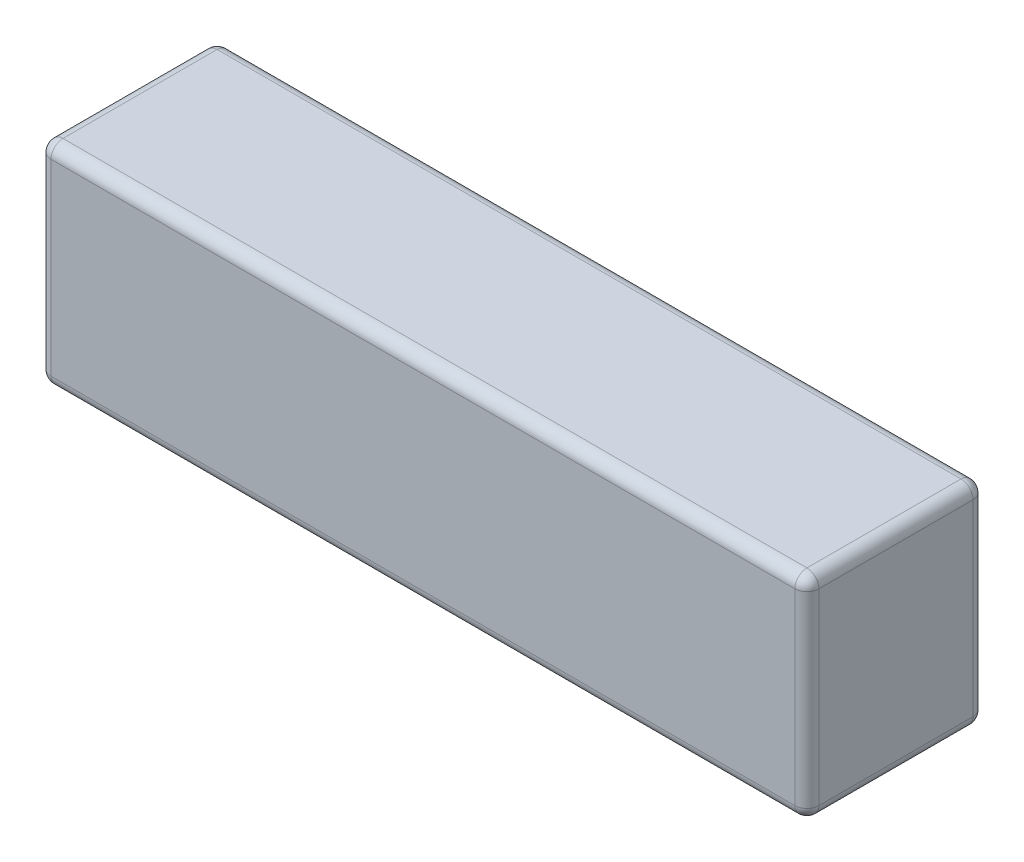
ISO-10303-21;
HEADER;
FILE_DESCRIPTION(('STEP AP214'),'2;1');
FILE_NAME('part.step','',(''),(''),'','','');
FILE_SCHEMA(('AUTOMOTIVE_DESIGN { 1 0 10303 214 1 1 1 1 }'));
ENDSEC;
DATA;
#1=APPLICATION_CONTEXT('core data for automotive mechanical design processes');
#2=APPLICATION_PROTOCOL_DEFINITION('international standard','automotive_design',2000,#1);
#3=PRODUCT_CONTEXT('',#1,'mechanical');
#4=PRODUCT('Part','Part','',(#3));
#5=PRODUCT_RELATED_PRODUCT_CATEGORY('part','',(#4));
#6=PRODUCT_DEFINITION_FORMATION('','',#4);
#7=PRODUCT_DEFINITION_CONTEXT('part definition',#1,'design');
#8=PRODUCT_DEFINITION('design','',#6,#7);
#9=PRODUCT_DEFINITION_SHAPE('','',#8);
#10=(LENGTH_UNIT() NAMED_UNIT(*) SI_UNIT(.MILLI.,.METRE.));
#11=(NAMED_UNIT(*) PLANE_ANGLE_UNIT() SI_UNIT($,.RADIAN.));
#12=(NAMED_UNIT(*) SI_UNIT($,.STERADIAN.) SOLID_ANGLE_UNIT());
#13=UNCERTAINTY_MEASURE_WITH_UNIT(LENGTH_MEASURE(1.E-05),#10,'distance_accuracy_value','');
#14=(GEOMETRIC_REPRESENTATION_CONTEXT(3) GLOBAL_UNCERTAINTY_ASSIGNED_CONTEXT((#13)) GLOBAL_UNIT_ASSIGNED_CONTEXT((#10,
#11,#12)) REPRESENTATION_CONTEXT('',''));
#15=CARTESIAN_POINT('',(0.,0.,0.));
#16=DIRECTION('',(0.,0.,1.));
#17=DIRECTION('',(1.,0.,0.));
#18=AXIS2_PLACEMENT_3D('',#15,#16,#17);
#19=CARTESIAN_POINT('',(-159.5,-44.,74.));
#20=DIRECTION('',(-1.,0.,0.));
#21=DIRECTION('',(0.,0.,1.));
#22=AXIS2_PLACEMENT_3D('',#19,#20,#21);
#23=PLANE('',#22);
#24=DIRECTION('',(0.,1.,0.));
#25=VECTOR('',#24,1.);
#26=CARTESIAN_POINT('',(-159.5,44.,69.));
#27=LINE('',#26,#25);
#28=CARTESIAN_POINT('',(-159.5,-39.,69.));
#29=VERTEX_POINT('',#28);
#30=CARTESIAN_POINT('',(-159.5,39.,69.));
#31=VERTEX_POINT('',#30);
#32=EDGE_CURVE('E200',#29,#31,#27,.T.);
#33=ORIENTED_EDGE('',*,*,#32,.T.);
#34=DIRECTION('',(0.,0.,-1.));
#35=VECTOR('',#34,1.);
#36=CARTESIAN_POINT('',(-159.5,39.,74.));
#37=LINE('',#36,#35);
#38=CARTESIAN_POINT('',(-159.5,39.,5.));
#39=VERTEX_POINT('',#38);
#40=EDGE_CURVE('E202',#31,#39,#37,.T.);
#41=ORIENTED_EDGE('',*,*,#40,.T.);
#42=DIRECTION('',(0.,1.,0.));
#43=VECTOR('',#42,1.);
#44=CARTESIAN_POINT('',(-159.5,-44.,5.));
#45=LINE('',#44,#43);
#46=CARTESIAN_POINT('',(-159.5,-39.,5.));
#47=VERTEX_POINT('',#46);
#48=EDGE_CURVE('E196',#39,#47,#45,.F.);
#49=ORIENTED_EDGE('',*,*,#48,.T.);
#50=DIRECTION('',(0.,0.,-1.));
#51=VECTOR('',#50,1.);
#52=CARTESIAN_POINT('',(-159.5,-39.,74.));
#53=LINE('',#52,#51);
#54=EDGE_CURVE('E198',#47,#29,#53,.F.);
#55=ORIENTED_EDGE('',*,*,#54,.T.);
#56=EDGE_LOOP('',(#33,#41,#49,#55));
#57=FACE_BOUND('',#56,.T.);
#58=ADVANCED_FACE('F40',(#57),#23,.T.);
#59=CARTESIAN_POINT('',(-159.5,-44.,74.));
#60=DIRECTION('',(0.,1.,0.));
#61=DIRECTION('',(0.,0.,1.));
#62=AXIS2_PLACEMENT_3D('',#59,#60,#61);
#63=PLANE('',#62);
#64=DIRECTION('',(0.,0.,-1.));
#65=VECTOR('',#64,1.);
#66=CARTESIAN_POINT('',(-154.5,-44.,0.));
#67=LINE('',#66,#65);
#68=CARTESIAN_POINT('',(-154.5,-44.,69.));
#69=VERTEX_POINT('',#68);
#70=CARTESIAN_POINT('',(-154.5,-44.,5.));
#71=VERTEX_POINT('',#70);
#72=EDGE_CURVE('E165',#69,#71,#67,.T.);
#73=ORIENTED_EDGE('',*,*,#72,.T.);
#74=DIRECTION('',(1.,0.,0.));
#75=VECTOR('',#74,1.);
#76=CARTESIAN_POINT('',(159.5,-44.,5.));
#77=LINE('',#76,#75);
#78=CARTESIAN_POINT('',(154.5,-44.,5.));
#79=VERTEX_POINT('',#78);
#80=EDGE_CURVE('E137',#71,#79,#77,.T.);
#81=ORIENTED_EDGE('',*,*,#80,.T.);
#82=DIRECTION('',(0.,0.,-1.));
#83=VECTOR('',#82,1.);
#84=CARTESIAN_POINT('',(154.5,-44.,74.));
#85=LINE('',#84,#83);
#86=CARTESIAN_POINT('',(154.5,-44.,69.));
#87=VERTEX_POINT('',#86);
#88=EDGE_CURVE('E155',#79,#87,#85,.F.);
#89=ORIENTED_EDGE('',*,*,#88,.T.);
#90=DIRECTION('',(1.,0.,0.));
#91=VECTOR('',#90,1.);
#92=CARTESIAN_POINT('',(-159.5,-44.,69.));
#93=LINE('',#92,#91);
#94=EDGE_CURVE('E161',#87,#69,#93,.F.);
#95=ORIENTED_EDGE('',*,*,#94,.T.);
#96=EDGE_LOOP('',(#73,#81,#89,#95));
#97=FACE_BOUND('',#96,.T.);
#98=ADVANCED_FACE('F163',(#97),#63,.F.);
#99=CARTESIAN_POINT('',(159.5,-44.,74.));
#100=DIRECTION('',(-1.,0.,0.));
#101=DIRECTION('',(0.,0.,1.));
#102=AXIS2_PLACEMENT_3D('',#99,#100,#101);
#103=PLANE('',#102);
#104=DIRECTION('',(0.,0.,-1.));
#105=VECTOR('',#104,1.);
#106=CARTESIAN_POINT('',(159.5,-39.,74.));
#107=LINE('',#106,#105);
#108=CARTESIAN_POINT('',(159.5,-39.,69.));
#109=VERTEX_POINT('',#108);
#110=CARTESIAN_POINT('',(159.5,-39.,5.));
#111=VERTEX_POINT('',#110);
#112=EDGE_CURVE('E182',#109,#111,#107,.T.);
#113=ORIENTED_EDGE('',*,*,#112,.T.);
#114=DIRECTION('',(0.,1.,0.));
#115=VECTOR('',#114,1.);
#116=CARTESIAN_POINT('',(159.5,44.,5.));
#117=LINE('',#116,#115);
#118=CARTESIAN_POINT('',(159.5,39.,5.));
#119=VERTEX_POINT('',#118);
#120=EDGE_CURVE('E184',#111,#119,#117,.T.);
#121=ORIENTED_EDGE('',*,*,#120,.T.);
#122=DIRECTION('',(0.,0.,-1.));
#123=VECTOR('',#122,1.);
#124=CARTESIAN_POINT('',(159.5,39.,74.));
#125=LINE('',#124,#123);
#126=CARTESIAN_POINT('',(159.5,39.,69.));
#127=VERTEX_POINT('',#126);
#128=EDGE_CURVE('E178',#119,#127,#125,.F.);
#129=ORIENTED_EDGE('',*,*,#128,.T.);
#130=DIRECTION('',(0.,1.,0.));
#131=VECTOR('',#130,1.);
#132=CARTESIAN_POINT('',(159.5,-44.,69.));
#133=LINE('',#132,#131);
#134=EDGE_CURVE('E180',#127,#109,#133,.F.);
#135=ORIENTED_EDGE('',*,*,#134,.T.);
#136=EDGE_LOOP('',(#113,#121,#129,#135));
#137=FACE_BOUND('',#136,.T.);
#138=ADVANCED_FACE('F329',(#137),#103,.F.);
#139=CARTESIAN_POINT('',(-159.5,44.,74.));
#140=DIRECTION('',(0.,1.,0.));
#141=DIRECTION('',(0.,0.,1.));
#142=AXIS2_PLACEMENT_3D('',#139,#140,#141);
#143=PLANE('',#142);
#144=DIRECTION('',(0.,0.,-1.));
#145=VECTOR('',#144,1.);
#146=CARTESIAN_POINT('',(154.5,44.,0.));
#147=LINE('',#146,#145);
#148=CARTESIAN_POINT('',(154.5,44.,69.));
#149=VERTEX_POINT('',#148);
#150=CARTESIAN_POINT('',(154.5,44.,5.));
#151=VERTEX_POINT('',#150);
#152=EDGE_CURVE('E189',#149,#151,#147,.T.);
#153=ORIENTED_EDGE('',*,*,#152,.T.);
#154=DIRECTION('',(1.,0.,0.));
#155=VECTOR('',#154,1.);
#156=CARTESIAN_POINT('',(-159.5,44.,5.));
#157=LINE('',#156,#155);
#158=CARTESIAN_POINT('',(-154.5,44.,5.));
#159=VERTEX_POINT('',#158);
#160=EDGE_CURVE('E193',#151,#159,#157,.F.);
#161=ORIENTED_EDGE('',*,*,#160,.T.);
#162=DIRECTION('',(0.,0.,-1.));
#163=VECTOR('',#162,1.);
#164=CARTESIAN_POINT('',(-154.5,44.,74.));
#165=LINE('',#164,#163);
#166=CARTESIAN_POINT('',(-154.5,44.,69.));
#167=VERTEX_POINT('',#166);
#168=EDGE_CURVE('E191',#159,#167,#165,.F.);
#169=ORIENTED_EDGE('',*,*,#168,.T.);
#170=DIRECTION('',(1.,0.,0.));
#171=VECTOR('',#170,1.);
#172=CARTESIAN_POINT('',(159.5,44.,69.));
#173=LINE('',#172,#171);
#174=EDGE_CURVE('E187',#167,#149,#173,.T.);
#175=ORIENTED_EDGE('',*,*,#174,.T.);
#176=EDGE_LOOP('',(#153,#161,#169,#175));
#177=FACE_BOUND('',#176,.T.);
#178=ADVANCED_FACE('F293',(#177),#143,.T.);
#179=CARTESIAN_POINT('',(0.,0.,74.));
#180=DIRECTION('',(0.,0.,-1.));
#181=DIRECTION('',(-1.,0.,0.));
#182=AXIS2_PLACEMENT_3D('',#179,#180,#181);
#183=PLANE('',#182);
#184=DIRECTION('',(1.,0.,0.));
#185=VECTOR('',#184,1.);
#186=CARTESIAN_POINT('',(-159.5,39.,74.));
#187=LINE('',#186,#185);
#188=CARTESIAN_POINT('',(154.5,39.,74.));
#189=VERTEX_POINT('',#188);
#190=CARTESIAN_POINT('',(-154.5,39.,74.));
#191=VERTEX_POINT('',#190);
#192=EDGE_CURVE('E205',#189,#191,#187,.F.);
#193=ORIENTED_EDGE('',*,*,#192,.T.);
#194=DIRECTION('',(0.,1.,0.));
#195=VECTOR('',#194,1.);
#196=CARTESIAN_POINT('',(-154.5,-44.,74.));
#197=LINE('',#196,#195);
#198=CARTESIAN_POINT('',(-154.5,-39.,74.));
#199=VERTEX_POINT('',#198);
#200=EDGE_CURVE('E11',#191,#199,#197,.F.);
#201=ORIENTED_EDGE('',*,*,#200,.T.);
#202=DIRECTION('',(1.,0.,0.));
#203=VECTOR('',#202,1.);
#204=CARTESIAN_POINT('',(0.,-39.,74.));
#205=LINE('',#204,#203);
#206=CARTESIAN_POINT('',(154.5,-39.,74.));
#207=VERTEX_POINT('',#206);
#208=EDGE_CURVE('E49',#199,#207,#205,.T.);
#209=ORIENTED_EDGE('',*,*,#208,.T.);
#210=DIRECTION('',(0.,1.,0.));
#211=VECTOR('',#210,1.);
#212=CARTESIAN_POINT('',(154.5,0.,74.));
#213=LINE('',#212,#211);
#214=EDGE_CURVE('E207',#207,#189,#213,.T.);
#215=ORIENTED_EDGE('',*,*,#214,.T.);
#216=EDGE_LOOP('',(#193,#201,#209,#215));
#217=FACE_BOUND('',#216,.T.);
#218=ADVANCED_FACE('F283',(#217),#183,.F.);
#219=CARTESIAN_POINT('',(0.,0.,0.));
#220=DIRECTION('',(0.,0.,-1.));
#221=DIRECTION('',(-1.,0.,0.));
#222=AXIS2_PLACEMENT_3D('',#219,#220,#221);
#223=PLANE('',#222);
#224=DIRECTION('',(0.,1.,0.));
#225=VECTOR('',#224,1.);
#226=CARTESIAN_POINT('',(154.5,-44.,0.));
#227=LINE('',#226,#225);
#228=CARTESIAN_POINT('',(154.5,39.,0.));
#229=VERTEX_POINT('',#228);
#230=CARTESIAN_POINT('',(154.5,-39.,0.));
#231=VERTEX_POINT('',#230);
#232=EDGE_CURVE('E175',#229,#231,#227,.F.);
#233=ORIENTED_EDGE('',*,*,#232,.T.);
#234=DIRECTION('',(1.,0.,0.));
#235=VECTOR('',#234,1.);
#236=CARTESIAN_POINT('',(-159.5,-39.,0.));
#237=LINE('',#236,#235);
#238=CARTESIAN_POINT('',(-154.5,-39.,0.));
#239=VERTEX_POINT('',#238);
#240=EDGE_CURVE('E139',#231,#239,#237,.F.);
#241=ORIENTED_EDGE('',*,*,#240,.T.);
#242=DIRECTION('',(0.,1.,0.));
#243=VECTOR('',#242,1.);
#244=CARTESIAN_POINT('',(-154.5,0.,0.));
#245=LINE('',#244,#243);
#246=CARTESIAN_POINT('',(-154.5,39.,0.));
#247=VERTEX_POINT('',#246);
#248=EDGE_CURVE('E167',#239,#247,#245,.T.);
#249=ORIENTED_EDGE('',*,*,#248,.T.);
#250=DIRECTION('',(1.,0.,0.));
#251=VECTOR('',#250,1.);
#252=CARTESIAN_POINT('',(0.,39.,0.));
#253=LINE('',#252,#251);
#254=EDGE_CURVE('E169',#247,#229,#253,.T.);
#255=ORIENTED_EDGE('',*,*,#254,.T.);
#256=EDGE_LOOP('',(#233,#241,#249,#255));
#257=FACE_BOUND('',#256,.T.);
#258=ADVANCED_FACE('F357',(#257),#223,.T.);
#259=CARTESIAN_POINT('',(-159.5,39.,69.));
#260=DIRECTION('',(-1.,0.,0.));
#261=DIRECTION('',(0.,0.,1.));
#262=AXIS2_PLACEMENT_3D('',#259,#260,#261);
#263=CYLINDRICAL_SURFACE('',#262,5.);
#264=CARTESIAN_POINT('',(-154.5,39.,69.));
#265=DIRECTION('',(-1.,0.,0.));
#266=DIRECTION('',(0.,0.,1.));
#267=AXIS2_PLACEMENT_3D('',#264,#265,#266);
#268=CIRCLE('',#267,5.);
#269=EDGE_CURVE('E44',#191,#167,#268,.T.);
#270=ORIENTED_EDGE('',*,*,#269,.F.);
#271=ORIENTED_EDGE('',*,*,#192,.F.);
#272=CARTESIAN_POINT('',(154.5,39.,69.));
#273=DIRECTION('',(1.,0.,0.));
#274=DIRECTION('',(0.,0.,-1.));
#275=AXIS2_PLACEMENT_3D('',#272,#273,#274);
#276=CIRCLE('',#275,5.);
#277=EDGE_CURVE('E257',#149,#189,#276,.T.);
#278=ORIENTED_EDGE('',*,*,#277,.F.);
#279=ORIENTED_EDGE('',*,*,#174,.F.);
#280=EDGE_LOOP('',(#270,#271,#278,#279));
#281=FACE_BOUND('',#280,.T.);
#282=ADVANCED_FACE('F42',(#281),#263,.T.);
#283=CARTESIAN_POINT('',(-154.5,39.,69.));
#284=DIRECTION('',(0.,1.,0.));
#285=DIRECTION('',(0.,0.,1.));
#286=AXIS2_PLACEMENT_3D('',#283,#284,#285);
#287=SPHERICAL_SURFACE('',#286,5.);
#288=CARTESIAN_POINT('',(-154.5,39.,69.));
#289=DIRECTION('',(0.,1.,0.));
#290=DIRECTION('',(0.,0.,1.));
#291=AXIS2_PLACEMENT_3D('',#288,#289,#290);
#292=CIRCLE('',#291,5.);
#293=EDGE_CURVE('E252',#191,#31,#292,.F.);
#294=ORIENTED_EDGE('',*,*,#293,.F.);
#295=ORIENTED_EDGE('',*,*,#269,.T.);
#296=CARTESIAN_POINT('',(-154.5,39.,69.));
#297=DIRECTION('',(0.,0.,1.));
#298=DIRECTION('',(1.,0.,0.));
#299=AXIS2_PLACEMENT_3D('',#296,#297,#298);
#300=CIRCLE('',#299,5.);
#301=EDGE_CURVE('E255',#31,#167,#300,.F.);
#302=ORIENTED_EDGE('',*,*,#301,.F.);
#303=EDGE_LOOP('',(#294,#295,#302));
#304=FACE_BOUND('',#303,.T.);
#305=ADVANCED_FACE('F268',(#304),#287,.T.);
#306=CARTESIAN_POINT('',(154.5,39.,69.));
#307=DIRECTION('',(0.,0.,1.));
#308=DIRECTION('',(1.,0.,0.));
#309=AXIS2_PLACEMENT_3D('',#306,#307,#308);
#310=SPHERICAL_SURFACE('',#309,5.);
#311=CARTESIAN_POINT('',(154.5,39.,69.));
#312=DIRECTION('',(0.,0.,1.));
#313=DIRECTION('',(1.,0.,0.));
#314=AXIS2_PLACEMENT_3D('',#311,#312,#313);
#315=CIRCLE('',#314,5.);
#316=EDGE_CURVE('E246',#149,#127,#315,.F.);
#317=ORIENTED_EDGE('',*,*,#316,.F.);
#318=ORIENTED_EDGE('',*,*,#277,.T.);
#319=CARTESIAN_POINT('',(154.5,39.,69.));
#320=DIRECTION('',(0.,1.,0.));
#321=DIRECTION('',(0.,0.,1.));
#322=AXIS2_PLACEMENT_3D('',#319,#320,#321);
#323=CIRCLE('',#322,5.);
#324=EDGE_CURVE('E249',#127,#189,#323,.F.);
#325=ORIENTED_EDGE('',*,*,#324,.F.);
#326=EDGE_LOOP('',(#317,#318,#325));
#327=FACE_BOUND('',#326,.T.);
#328=ADVANCED_FACE('F285',(#327),#310,.T.);
#329=CARTESIAN_POINT('',(-154.5,39.,74.));
#330=DIRECTION('',(0.,0.,-1.));
#331=DIRECTION('',(-1.,0.,0.));
#332=AXIS2_PLACEMENT_3D('',#329,#330,#331);
#333=CYLINDRICAL_SURFACE('',#332,5.);
#334=ORIENTED_EDGE('',*,*,#301,.T.);
#335=ORIENTED_EDGE('',*,*,#168,.F.);
#336=CARTESIAN_POINT('',(-154.5,39.,5.));
#337=DIRECTION('',(0.,0.,-1.));
#338=DIRECTION('',(-1.,0.,0.));
#339=AXIS2_PLACEMENT_3D('',#336,#337,#338);
#340=CIRCLE('',#339,5.);
#341=EDGE_CURVE('E241',#39,#159,#340,.T.);
#342=ORIENTED_EDGE('',*,*,#341,.F.);
#343=ORIENTED_EDGE('',*,*,#40,.F.);
#344=EDGE_LOOP('',(#334,#335,#342,#343));
#345=FACE_BOUND('',#344,.T.);
#346=ADVANCED_FACE('F276',(#345),#333,.T.);
#347=CARTESIAN_POINT('',(-154.5,-44.,69.));
#348=DIRECTION('',(0.,-1.,0.));
#349=DIRECTION('',(0.,0.,-1.));
#350=AXIS2_PLACEMENT_3D('',#347,#348,#349);
#351=CYLINDRICAL_SURFACE('',#350,5.);
#352=ORIENTED_EDGE('',*,*,#293,.T.);
#353=ORIENTED_EDGE('',*,*,#32,.F.);
#354=CARTESIAN_POINT('',(-154.5,-39.,69.));
#355=DIRECTION('',(0.,-1.,0.));
#356=DIRECTION('',(0.,0.,-1.));
#357=AXIS2_PLACEMENT_3D('',#354,#355,#356);
#358=CIRCLE('',#357,5.);
#359=EDGE_CURVE('E239',#199,#29,#358,.T.);
#360=ORIENTED_EDGE('',*,*,#359,.F.);
#361=ORIENTED_EDGE('',*,*,#200,.F.);
#362=EDGE_LOOP('',(#352,#353,#360,#361));
#363=FACE_BOUND('',#362,.T.);
#364=ADVANCED_FACE('F282',(#363),#351,.T.);
#365=CARTESIAN_POINT('',(0.,-39.,69.));
#366=DIRECTION('',(1.,0.,0.));
#367=DIRECTION('',(0.,0.,-1.));
#368=AXIS2_PLACEMENT_3D('',#365,#366,#367);
#369=CYLINDRICAL_SURFACE('',#368,5.);
#370=CARTESIAN_POINT('',(154.5,-39.,69.));
#371=DIRECTION('',(1.,0.,0.));
#372=DIRECTION('',(0.,0.,-1.));
#373=AXIS2_PLACEMENT_3D('',#370,#371,#372);
#374=CIRCLE('',#373,5.);
#375=EDGE_CURVE('E235',#207,#87,#374,.T.);
#376=ORIENTED_EDGE('',*,*,#375,.F.);
#377=ORIENTED_EDGE('',*,*,#208,.F.);
#378=CARTESIAN_POINT('',(-154.5,-39.,69.));
#379=DIRECTION('',(-1.,0.,0.));
#380=DIRECTION('',(0.,0.,1.));
#381=AXIS2_PLACEMENT_3D('',#378,#379,#380);
#382=CIRCLE('',#381,5.);
#383=EDGE_CURVE('E57',#69,#199,#382,.T.);
#384=ORIENTED_EDGE('',*,*,#383,.F.);
#385=ORIENTED_EDGE('',*,*,#94,.F.);
#386=EDGE_LOOP('',(#376,#377,#384,#385));
#387=FACE_BOUND('',#386,.T.);
#388=ADVANCED_FACE('F375',(#387),#369,.T.);
#389=CARTESIAN_POINT('',(154.5,0.,69.));
#390=DIRECTION('',(0.,1.,0.));
#391=DIRECTION('',(0.,0.,1.));
#392=AXIS2_PLACEMENT_3D('',#389,#390,#391);
#393=CYLINDRICAL_SURFACE('',#392,5.);
#394=ORIENTED_EDGE('',*,*,#324,.T.);
#395=ORIENTED_EDGE('',*,*,#214,.F.);
#396=CARTESIAN_POINT('',(154.5,-39.,69.));
#397=DIRECTION('',(0.,-1.,0.));
#398=DIRECTION('',(0.,0.,-1.));
#399=AXIS2_PLACEMENT_3D('',#396,#397,#398);
#400=CIRCLE('',#399,5.);
#401=EDGE_CURVE('E232',#109,#207,#400,.T.);
#402=ORIENTED_EDGE('',*,*,#401,.F.);
#403=ORIENTED_EDGE('',*,*,#134,.F.);
#404=EDGE_LOOP('',(#394,#395,#402,#403));
#405=FACE_BOUND('',#404,.T.);
#406=ADVANCED_FACE('F372',(#405),#393,.T.);
#407=CARTESIAN_POINT('',(154.5,39.,74.));
#408=DIRECTION('',(0.,0.,1.));
#409=DIRECTION('',(1.,0.,0.));
#410=AXIS2_PLACEMENT_3D('',#407,#408,#409);
#411=CYLINDRICAL_SURFACE('',#410,5.);
#412=ORIENTED_EDGE('',*,*,#316,.T.);
#413=ORIENTED_EDGE('',*,*,#128,.F.);
#414=CARTESIAN_POINT('',(154.5,39.,5.));
#415=DIRECTION('',(0.,0.,-1.));
#416=DIRECTION('',(-1.,0.,0.));
#417=AXIS2_PLACEMENT_3D('',#414,#415,#416);
#418=CIRCLE('',#417,5.);
#419=EDGE_CURVE('E229',#151,#119,#418,.T.);
#420=ORIENTED_EDGE('',*,*,#419,.F.);
#421=ORIENTED_EDGE('',*,*,#152,.F.);
#422=EDGE_LOOP('',(#412,#413,#420,#421));
#423=FACE_BOUND('',#422,.T.);
#424=ADVANCED_FACE('F290',(#423),#411,.T.);
#425=CARTESIAN_POINT('',(0.,39.,5.));
#426=DIRECTION('',(1.,0.,0.));
#427=DIRECTION('',(0.,0.,-1.));
#428=AXIS2_PLACEMENT_3D('',#425,#426,#427);
#429=CYLINDRICAL_SURFACE('',#428,5.);
#430=CARTESIAN_POINT('',(-154.5,39.,5.));
#431=DIRECTION('',(-1.,0.,0.));
#432=DIRECTION('',(0.,0.,1.));
#433=AXIS2_PLACEMENT_3D('',#430,#431,#432);
#434=CIRCLE('',#433,5.);
#435=EDGE_CURVE('E243',#159,#247,#434,.T.);
#436=ORIENTED_EDGE('',*,*,#435,.F.);
#437=ORIENTED_EDGE('',*,*,#160,.F.);
#438=CARTESIAN_POINT('',(154.5,39.,5.));
#439=DIRECTION('',(1.,0.,0.));
#440=DIRECTION('',(0.,0.,-1.));
#441=AXIS2_PLACEMENT_3D('',#438,#439,#440);
#442=CIRCLE('',#441,5.);
#443=EDGE_CURVE('E226',#229,#151,#442,.T.);
#444=ORIENTED_EDGE('',*,*,#443,.F.);
#445=ORIENTED_EDGE('',*,*,#254,.F.);
#446=EDGE_LOOP('',(#436,#437,#444,#445));
#447=FACE_BOUND('',#446,.T.);
#448=ADVANCED_FACE('F297',(#447),#429,.T.);
#449=CARTESIAN_POINT('',(-154.5,39.,5.));
#450=DIRECTION('',(0.,1.,0.));
#451=DIRECTION('',(0.,0.,1.));
#452=AXIS2_PLACEMENT_3D('',#449,#450,#451);
#453=SPHERICAL_SURFACE('',#452,5.);
#454=ORIENTED_EDGE('',*,*,#341,.T.);
#455=ORIENTED_EDGE('',*,*,#435,.T.);
#456=CARTESIAN_POINT('',(-154.5,39.,5.));
#457=DIRECTION('',(0.,1.,0.));
#458=DIRECTION('',(-1.,0.,0.));
#459=AXIS2_PLACEMENT_3D('',#456,#457,#458);
#460=CIRCLE('',#459,5.);
#461=EDGE_CURVE('E223',#39,#247,#460,.F.);
#462=ORIENTED_EDGE('',*,*,#461,.F.);
#463=EDGE_LOOP('',(#454,#455,#462));
#464=FACE_BOUND('',#463,.T.);
#465=ADVANCED_FACE('F302',(#464),#453,.T.);
#466=CARTESIAN_POINT('',(-154.5,-39.,69.));
#467=DIRECTION('',(0.,0.,1.));
#468=DIRECTION('',(1.,0.,0.));
#469=AXIS2_PLACEMENT_3D('',#466,#467,#468);
#470=SPHERICAL_SURFACE('',#469,5.);
#471=ORIENTED_EDGE('',*,*,#383,.T.);
#472=ORIENTED_EDGE('',*,*,#359,.T.);
#473=CARTESIAN_POINT('',(-154.5,-39.,69.));
#474=DIRECTION('',(0.,0.,1.));
#475=DIRECTION('',(1.,0.,0.));
#476=AXIS2_PLACEMENT_3D('',#473,#474,#475);
#477=CIRCLE('',#476,5.);
#478=EDGE_CURVE('E220',#69,#29,#477,.F.);
#479=ORIENTED_EDGE('',*,*,#478,.F.);
#480=EDGE_LOOP('',(#471,#472,#479));
#481=FACE_BOUND('',#480,.T.);
#482=ADVANCED_FACE('F312',(#481),#470,.T.);
#483=CARTESIAN_POINT('',(154.5,-39.,69.));
#484=DIRECTION('',(0.,0.,1.));
#485=DIRECTION('',(1.,0.,0.));
#486=AXIS2_PLACEMENT_3D('',#483,#484,#485);
#487=SPHERICAL_SURFACE('',#486,5.);
#488=ORIENTED_EDGE('',*,*,#401,.T.);
#489=ORIENTED_EDGE('',*,*,#375,.T.);
#490=CARTESIAN_POINT('',(154.5,-39.,69.));
#491=DIRECTION('',(0.,0.,1.));
#492=DIRECTION('',(1.,0.,0.));
#493=AXIS2_PLACEMENT_3D('',#490,#491,#492);
#494=CIRCLE('',#493,5.);
#495=EDGE_CURVE('E158',#109,#87,#494,.F.);
#496=ORIENTED_EDGE('',*,*,#495,.F.);
#497=EDGE_LOOP('',(#488,#489,#496));
#498=FACE_BOUND('',#497,.T.);
#499=ADVANCED_FACE('F314',(#498),#487,.T.);
#500=CARTESIAN_POINT('',(154.5,39.,5.));
#501=DIRECTION('',(0.,1.,0.));
#502=DIRECTION('',(0.,0.,1.));
#503=AXIS2_PLACEMENT_3D('',#500,#501,#502);
#504=SPHERICAL_SURFACE('',#503,5.);
#505=ORIENTED_EDGE('',*,*,#443,.T.);
#506=ORIENTED_EDGE('',*,*,#419,.T.);
#507=CARTESIAN_POINT('',(154.5,39.,5.));
#508=DIRECTION('',(0.,1.,0.));
#509=DIRECTION('',(0.,0.,1.));
#510=AXIS2_PLACEMENT_3D('',#507,#508,#509);
#511=CIRCLE('',#510,5.);
#512=EDGE_CURVE('E217',#229,#119,#511,.F.);
#513=ORIENTED_EDGE('',*,*,#512,.F.);
#514=EDGE_LOOP('',(#505,#506,#513));
#515=FACE_BOUND('',#514,.T.);
#516=ADVANCED_FACE('F320',(#515),#504,.T.);
#517=CARTESIAN_POINT('',(-154.5,0.,5.));
#518=DIRECTION('',(0.,1.,0.));
#519=DIRECTION('',(0.,0.,1.));
#520=AXIS2_PLACEMENT_3D('',#517,#518,#519);
#521=CYLINDRICAL_SURFACE('',#520,5.);
#522=ORIENTED_EDGE('',*,*,#461,.T.);
#523=ORIENTED_EDGE('',*,*,#248,.F.);
#524=CARTESIAN_POINT('',(-154.5,-39.,5.));
#525=DIRECTION('',(0.,-1.,0.));
#526=DIRECTION('',(0.,0.,-1.));
#527=AXIS2_PLACEMENT_3D('',#524,#525,#526);
#528=CIRCLE('',#527,5.);
#529=EDGE_CURVE('E214',#47,#239,#528,.T.);
#530=ORIENTED_EDGE('',*,*,#529,.F.);
#531=ORIENTED_EDGE('',*,*,#48,.F.);
#532=EDGE_LOOP('',(#522,#523,#530,#531));
#533=FACE_BOUND('',#532,.T.);
#534=ADVANCED_FACE('F305',(#533),#521,.T.);
#535=CARTESIAN_POINT('',(-154.5,-39.,74.));
#536=DIRECTION('',(0.,0.,1.));
#537=DIRECTION('',(1.,0.,0.));
#538=AXIS2_PLACEMENT_3D('',#535,#536,#537);
#539=CYLINDRICAL_SURFACE('',#538,5.);
#540=ORIENTED_EDGE('',*,*,#478,.T.);
#541=ORIENTED_EDGE('',*,*,#54,.F.);
#542=CARTESIAN_POINT('',(-154.5,-39.,5.));
#543=DIRECTION('',(0.,0.,-1.));
#544=DIRECTION('',(-1.,0.,0.));
#545=AXIS2_PLACEMENT_3D('',#542,#543,#544);
#546=CIRCLE('',#545,5.);
#547=EDGE_CURVE('E152',#71,#47,#546,.T.);
#548=ORIENTED_EDGE('',*,*,#547,.F.);
#549=ORIENTED_EDGE('',*,*,#72,.F.);
#550=EDGE_LOOP('',(#540,#541,#548,#549));
#551=FACE_BOUND('',#550,.T.);
#552=ADVANCED_FACE('F311',(#551),#539,.T.);
#553=CARTESIAN_POINT('',(154.5,-39.,74.));
#554=DIRECTION('',(0.,0.,-1.));
#555=DIRECTION('',(-1.,0.,0.));
#556=AXIS2_PLACEMENT_3D('',#553,#554,#555);
#557=CYLINDRICAL_SURFACE('',#556,5.);
#558=ORIENTED_EDGE('',*,*,#495,.T.);
#559=ORIENTED_EDGE('',*,*,#88,.F.);
#560=CARTESIAN_POINT('',(154.5,-39.,5.));
#561=DIRECTION('',(0.,0.,-1.));
#562=DIRECTION('',(-1.,0.,0.));
#563=AXIS2_PLACEMENT_3D('',#560,#561,#562);
#564=CIRCLE('',#563,5.);
#565=EDGE_CURVE('E145',#111,#79,#564,.T.);
#566=ORIENTED_EDGE('',*,*,#565,.F.);
#567=ORIENTED_EDGE('',*,*,#112,.F.);
#568=EDGE_LOOP('',(#558,#559,#566,#567));
#569=FACE_BOUND('',#568,.T.);
#570=ADVANCED_FACE('F156',(#569),#557,.T.);
#571=CARTESIAN_POINT('',(154.5,-44.,5.));
#572=DIRECTION('',(0.,-1.,0.));
#573=DIRECTION('',(0.,0.,-1.));
#574=AXIS2_PLACEMENT_3D('',#571,#572,#573);
#575=CYLINDRICAL_SURFACE('',#574,5.);
#576=ORIENTED_EDGE('',*,*,#512,.T.);
#577=ORIENTED_EDGE('',*,*,#120,.F.);
#578=CARTESIAN_POINT('',(154.5,-39.,5.));
#579=DIRECTION('',(0.,-1.,0.));
#580=DIRECTION('',(0.,0.,-1.));
#581=AXIS2_PLACEMENT_3D('',#578,#579,#580);
#582=CIRCLE('',#581,5.);
#583=EDGE_CURVE('E149',#231,#111,#582,.T.);
#584=ORIENTED_EDGE('',*,*,#583,.F.);
#585=ORIENTED_EDGE('',*,*,#232,.F.);
#586=EDGE_LOOP('',(#576,#577,#584,#585));
#587=FACE_BOUND('',#586,.T.);
#588=ADVANCED_FACE('F340',(#587),#575,.T.);
#589=CARTESIAN_POINT('',(-154.5,-39.,5.));
#590=DIRECTION('',(-1.,0.,0.));
#591=DIRECTION('',(0.,0.,1.));
#592=AXIS2_PLACEMENT_3D('',#589,#590,#591);
#593=SPHERICAL_SURFACE('',#592,5.);
#594=ORIENTED_EDGE('',*,*,#547,.T.);
#595=ORIENTED_EDGE('',*,*,#529,.T.);
#596=CARTESIAN_POINT('',(-154.5,-39.,5.));
#597=DIRECTION('',(-1.,0.,0.));
#598=DIRECTION('',(0.,0.,1.));
#599=AXIS2_PLACEMENT_3D('',#596,#597,#598);
#600=CIRCLE('',#599,5.);
#601=EDGE_CURVE('E142',#71,#239,#600,.F.);
#602=ORIENTED_EDGE('',*,*,#601,.F.);
#603=EDGE_LOOP('',(#594,#595,#602));
#604=FACE_BOUND('',#603,.T.);
#605=ADVANCED_FACE('F309',(#604),#593,.T.);
#606=CARTESIAN_POINT('',(154.5,-39.,5.));
#607=DIRECTION('',(1.,0.,0.));
#608=DIRECTION('',(0.,0.,-1.));
#609=AXIS2_PLACEMENT_3D('',#606,#607,#608);
#610=SPHERICAL_SURFACE('',#609,5.);
#611=ORIENTED_EDGE('',*,*,#583,.T.);
#612=ORIENTED_EDGE('',*,*,#565,.T.);
#613=CARTESIAN_POINT('',(154.5,-39.,5.));
#614=DIRECTION('',(1.,0.,0.));
#615=DIRECTION('',(0.,0.,-1.));
#616=AXIS2_PLACEMENT_3D('',#613,#614,#615);
#617=CIRCLE('',#616,5.);
#618=EDGE_CURVE('E133',#231,#79,#617,.F.);
#619=ORIENTED_EDGE('',*,*,#618,.F.);
#620=EDGE_LOOP('',(#611,#612,#619));
#621=FACE_BOUND('',#620,.T.);
#622=ADVANCED_FACE('F147',(#621),#610,.T.);
#623=CARTESIAN_POINT('',(-159.5,-39.,5.));
#624=DIRECTION('',(-1.,0.,0.));
#625=DIRECTION('',(0.,0.,1.));
#626=AXIS2_PLACEMENT_3D('',#623,#624,#625);
#627=CYLINDRICAL_SURFACE('',#626,5.);
#628=ORIENTED_EDGE('',*,*,#601,.T.);
#629=ORIENTED_EDGE('',*,*,#240,.F.);
#630=ORIENTED_EDGE('',*,*,#618,.T.);
#631=ORIENTED_EDGE('',*,*,#80,.F.);
#632=EDGE_LOOP('',(#628,#629,#630,#631));
#633=FACE_BOUND('',#632,.T.);
#634=ADVANCED_FACE('F135',(#633),#627,.T.);
#635=CLOSED_SHELL('',(#58,#98,#138,#178,#218,#258,#282,#305,#328,#346,#364,#388,#406,#424,#448,
#465,#482,#499,#516,#534,#552,#570,#588,#605,#622,#634));
#636=MANIFOLD_SOLID_BREP('B2',#635);
#637=ADVANCED_BREP_SHAPE_REPRESENTATION('',(#18,#636),#14);
#638=SHAPE_DEFINITION_REPRESENTATION(#9,#637);
ENDSEC;
END-ISO-10303-21;
